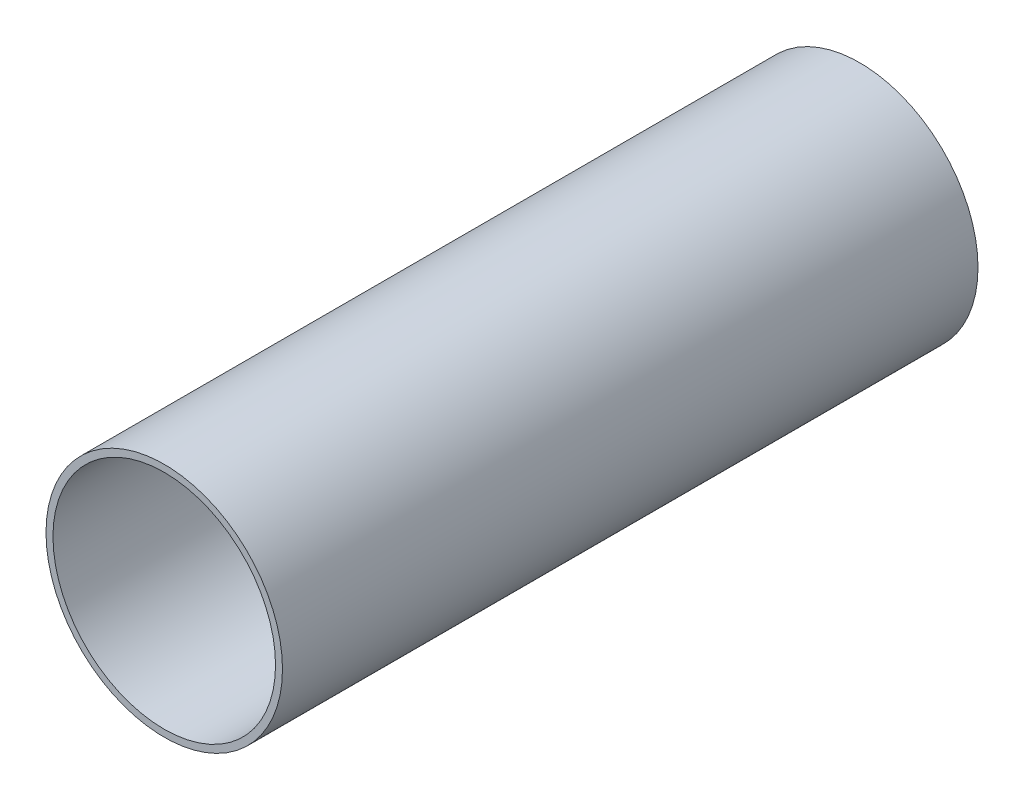
ISO-10303-21;
HEADER;
FILE_DESCRIPTION(('STEP AP214'),'2;1');
FILE_NAME('part.step','',(''),(''),'','','');
FILE_SCHEMA(('AUTOMOTIVE_DESIGN { 1 0 10303 214 1 1 1 1 }'));
ENDSEC;
DATA;
#1=APPLICATION_CONTEXT('core data for automotive mechanical design processes');
#2=APPLICATION_PROTOCOL_DEFINITION('international standard','automotive_design',2000,#1);
#3=PRODUCT_CONTEXT('',#1,'mechanical');
#4=PRODUCT('Part','Part','',(#3));
#5=PRODUCT_RELATED_PRODUCT_CATEGORY('part','',(#4));
#6=PRODUCT_DEFINITION_FORMATION('','',#4);
#7=PRODUCT_DEFINITION_CONTEXT('part definition',#1,'design');
#8=PRODUCT_DEFINITION('design','',#6,#7);
#9=PRODUCT_DEFINITION_SHAPE('','',#8);
#10=(LENGTH_UNIT() NAMED_UNIT(*) SI_UNIT(.MILLI.,.METRE.));
#11=(NAMED_UNIT(*) PLANE_ANGLE_UNIT() SI_UNIT($,.RADIAN.));
#12=(NAMED_UNIT(*) SI_UNIT($,.STERADIAN.) SOLID_ANGLE_UNIT());
#13=UNCERTAINTY_MEASURE_WITH_UNIT(LENGTH_MEASURE(1.E-05),#10,'distance_accuracy_value','');
#14=(GEOMETRIC_REPRESENTATION_CONTEXT(3) GLOBAL_UNCERTAINTY_ASSIGNED_CONTEXT((#13)) GLOBAL_UNIT_ASSIGNED_CONTEXT((#10,
#11,#12)) REPRESENTATION_CONTEXT('',''));
#15=CARTESIAN_POINT('',(0.,0.,0.));
#16=DIRECTION('',(0.,0.,1.));
#17=DIRECTION('',(1.,0.,0.));
#18=AXIS2_PLACEMENT_3D('',#15,#16,#17);
#19=CARTESIAN_POINT('',(0.,0.,25.));
#20=DIRECTION('',(0.,0.,1.));
#21=DIRECTION('',(1.,0.,0.));
#22=AXIS2_PLACEMENT_3D('',#19,#20,#21);
#23=PLANE('',#22);
#24=CARTESIAN_POINT('',(0.,0.,25.));
#25=DIRECTION('',(0.,0.,1.));
#26=DIRECTION('',(1.,0.,0.));
#27=AXIS2_PLACEMENT_3D('',#24,#25,#26);
#28=CIRCLE('',#27,4.25);
#29=CARTESIAN_POINT('',(4.25,0.,25.));
#30=VERTEX_POINT('',#29);
#31=EDGE_CURVE('E10',#30,#30,#28,.T.);
#32=ORIENTED_EDGE('',*,*,#31,.T.);
#33=EDGE_LOOP('',(#32));
#34=FACE_BOUND('',#33,.T.);
#35=CARTESIAN_POINT('',(0.,0.,25.));
#36=DIRECTION('',(0.,0.,1.));
#37=DIRECTION('',(1.,0.,0.));
#38=AXIS2_PLACEMENT_3D('',#35,#36,#37);
#39=CIRCLE('',#38,4.);
#40=CARTESIAN_POINT('',(4.,0.,25.));
#41=VERTEX_POINT('',#40);
#42=EDGE_CURVE('E41',#41,#41,#39,.T.);
#43=ORIENTED_EDGE('',*,*,#42,.F.);
#44=EDGE_LOOP('',(#43));
#45=FACE_BOUND('',#44,.T.);
#46=ADVANCED_FACE('F30',(#34,#45),#23,.T.);
#47=CARTESIAN_POINT('',(0.,0.,0.));
#48=DIRECTION('',(0.,0.,1.));
#49=DIRECTION('',(1.,0.,0.));
#50=AXIS2_PLACEMENT_3D('',#47,#48,#49);
#51=PLANE('',#50);
#52=CARTESIAN_POINT('',(0.,0.,0.));
#53=DIRECTION('',(0.,0.,1.));
#54=DIRECTION('',(1.,0.,0.));
#55=AXIS2_PLACEMENT_3D('',#52,#53,#54);
#56=CIRCLE('',#55,4.25);
#57=CARTESIAN_POINT('',(4.25,0.,0.));
#58=VERTEX_POINT('',#57);
#59=EDGE_CURVE('E34',#58,#58,#56,.T.);
#60=ORIENTED_EDGE('',*,*,#59,.F.);
#61=EDGE_LOOP('',(#60));
#62=FACE_BOUND('',#61,.T.);
#63=CARTESIAN_POINT('',(0.,0.,0.));
#64=DIRECTION('',(0.,0.,1.));
#65=DIRECTION('',(1.,0.,0.));
#66=AXIS2_PLACEMENT_3D('',#63,#64,#65);
#67=CIRCLE('',#66,4.);
#68=CARTESIAN_POINT('',(4.,0.,0.));
#69=VERTEX_POINT('',#68);
#70=EDGE_CURVE('E43',#69,#69,#67,.T.);
#71=ORIENTED_EDGE('',*,*,#70,.T.);
#72=EDGE_LOOP('',(#71));
#73=FACE_BOUND('',#72,.T.);
#74=ADVANCED_FACE('F53',(#62,#73),#51,.F.);
#75=CARTESIAN_POINT('',(0.,0.,25.));
#76=DIRECTION('',(0.,0.,-1.));
#77=DIRECTION('',(-1.,0.,0.));
#78=AXIS2_PLACEMENT_3D('',#75,#76,#77);
#79=CYLINDRICAL_SURFACE('',#78,4.25);
#80=ORIENTED_EDGE('',*,*,#31,.F.);
#81=EDGE_LOOP('',(#80));
#82=FACE_BOUND('',#81,.T.);
#83=ORIENTED_EDGE('',*,*,#59,.T.);
#84=EDGE_LOOP('',(#83));
#85=FACE_BOUND('',#84,.T.);
#86=ADVANCED_FACE('F32',(#82,#85),#79,.T.);
#87=CARTESIAN_POINT('',(0.,0.,25.));
#88=DIRECTION('',(0.,0.,-1.));
#89=DIRECTION('',(-1.,0.,0.));
#90=AXIS2_PLACEMENT_3D('',#87,#88,#89);
#91=CYLINDRICAL_SURFACE('',#90,4.);
#92=ORIENTED_EDGE('',*,*,#42,.T.);
#93=EDGE_LOOP('',(#92));
#94=FACE_BOUND('',#93,.T.);
#95=ORIENTED_EDGE('',*,*,#70,.F.);
#96=EDGE_LOOP('',(#95));
#97=FACE_BOUND('',#96,.T.);
#98=ADVANCED_FACE('F49',(#94,#97),#91,.F.);
#99=CLOSED_SHELL('',(#46,#74,#86,#98));
#100=MANIFOLD_SOLID_BREP('B2',#99);
#101=ADVANCED_BREP_SHAPE_REPRESENTATION('',(#18,#100),#14);
#102=SHAPE_DEFINITION_REPRESENTATION(#9,#101);
ENDSEC;
END-ISO-10303-21;
